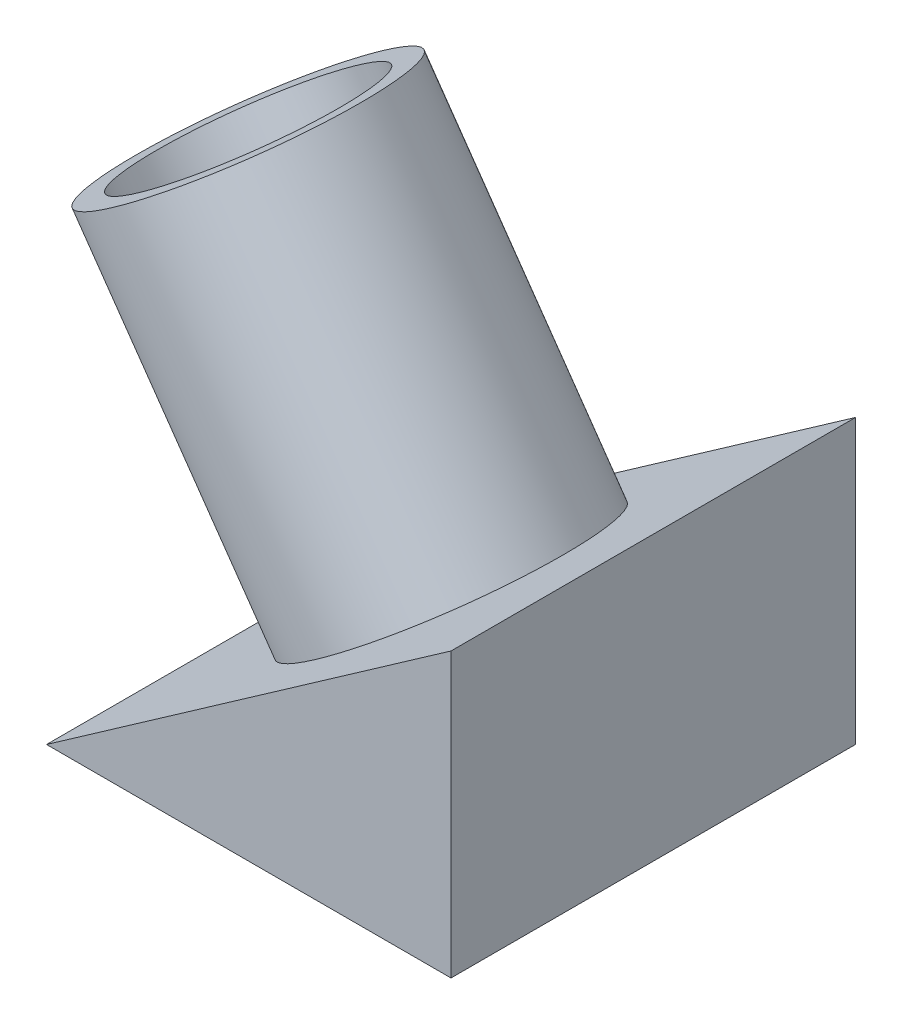
ISO-10303-21;
HEADER;
FILE_DESCRIPTION(('STEP AP214'),'2;1');
FILE_NAME('part.step','',(''),(''),'','','');
FILE_SCHEMA(('AUTOMOTIVE_DESIGN { 1 0 10303 214 1 1 1 1 }'));
ENDSEC;
DATA;
#1=APPLICATION_CONTEXT('core data for automotive mechanical design processes');
#2=APPLICATION_PROTOCOL_DEFINITION('international standard','automotive_design',2000,#1);
#3=PRODUCT_CONTEXT('',#1,'mechanical');
#4=PRODUCT('Part','Part','',(#3));
#5=PRODUCT_RELATED_PRODUCT_CATEGORY('part','',(#4));
#6=PRODUCT_DEFINITION_FORMATION('','',#4);
#7=PRODUCT_DEFINITION_CONTEXT('part definition',#1,'design');
#8=PRODUCT_DEFINITION('design','',#6,#7);
#9=PRODUCT_DEFINITION_SHAPE('','',#8);
#10=(LENGTH_UNIT() NAMED_UNIT(*) SI_UNIT(.MILLI.,.METRE.));
#11=(NAMED_UNIT(*) PLANE_ANGLE_UNIT() SI_UNIT($,.RADIAN.));
#12=(NAMED_UNIT(*) SI_UNIT($,.STERADIAN.) SOLID_ANGLE_UNIT());
#13=UNCERTAINTY_MEASURE_WITH_UNIT(LENGTH_MEASURE(1.E-05),#10,'distance_accuracy_value','');
#14=(GEOMETRIC_REPRESENTATION_CONTEXT(3) GLOBAL_UNCERTAINTY_ASSIGNED_CONTEXT((#13)) GLOBAL_UNIT_ASSIGNED_CONTEXT((#10,
#11,#12)) REPRESENTATION_CONTEXT('',''));
#15=CARTESIAN_POINT('',(0.,0.,0.));
#16=DIRECTION('',(0.,0.,1.));
#17=DIRECTION('',(1.,0.,0.));
#18=AXIS2_PLACEMENT_3D('',#15,#16,#17);
#19=CARTESIAN_POINT('',(40.,0.,40.));
#20=DIRECTION('',(0.,1.,0.));
#21=DIRECTION('',(-1.,0.,0.));
#22=AXIS2_PLACEMENT_3D('',#19,#20,#21);
#23=PLANE('',#22);
#24=DIRECTION('',(1.,0.,0.));
#25=VECTOR('',#24,1.);
#26=CARTESIAN_POINT('',(40.,0.,0.));
#27=LINE('',#26,#25);
#28=CARTESIAN_POINT('',(0.,0.,0.));
#29=VERTEX_POINT('',#28);
#30=CARTESIAN_POINT('',(40.,0.,0.));
#31=VERTEX_POINT('',#30);
#32=EDGE_CURVE('E92',#29,#31,#27,.T.);
#33=ORIENTED_EDGE('',*,*,#32,.T.);
#34=DIRECTION('',(0.,0.,-1.));
#35=VECTOR('',#34,1.);
#36=CARTESIAN_POINT('',(40.,0.,40.));
#37=LINE('',#36,#35);
#38=CARTESIAN_POINT('',(40.,0.,40.));
#39=VERTEX_POINT('',#38);
#40=EDGE_CURVE('E42',#39,#31,#37,.T.);
#41=ORIENTED_EDGE('',*,*,#40,.F.);
#42=DIRECTION('',(1.,0.,0.));
#43=VECTOR('',#42,1.);
#44=CARTESIAN_POINT('',(40.,0.,40.));
#45=LINE('',#44,#43);
#46=CARTESIAN_POINT('',(0.,0.,40.));
#47=VERTEX_POINT('',#46);
#48=EDGE_CURVE('E84',#47,#39,#45,.T.);
#49=ORIENTED_EDGE('',*,*,#48,.F.);
#50=DIRECTION('',(0.,0.,-1.));
#51=VECTOR('',#50,1.);
#52=CARTESIAN_POINT('',(0.,0.,40.));
#53=LINE('',#52,#51);
#54=EDGE_CURVE('E95',#47,#29,#53,.T.);
#55=ORIENTED_EDGE('',*,*,#54,.T.);
#56=EDGE_LOOP('',(#33,#41,#49,#55));
#57=FACE_BOUND('',#56,.T.);
#58=ADVANCED_FACE('F39',(#57),#23,.F.);
#59=CARTESIAN_POINT('',(40.,28.0083015283881,40.));
#60=DIRECTION('',(-1.,0.,0.));
#61=DIRECTION('',(0.,-1.,0.));
#62=AXIS2_PLACEMENT_3D('',#59,#60,#61);
#63=PLANE('',#62);
#64=DIRECTION('',(0.,1.,0.));
#65=VECTOR('',#64,1.);
#66=CARTESIAN_POINT('',(40.,28.0083015283881,0.));
#67=LINE('',#66,#65);
#68=CARTESIAN_POINT('',(40.,28.0083015283881,0.));
#69=VERTEX_POINT('',#68);
#70=EDGE_CURVE('E70',#31,#69,#67,.T.);
#71=ORIENTED_EDGE('',*,*,#70,.T.);
#72=DIRECTION('',(0.,0.,-1.));
#73=VECTOR('',#72,1.);
#74=CARTESIAN_POINT('',(40.,28.0083015283881,40.));
#75=LINE('',#74,#73);
#76=CARTESIAN_POINT('',(40.,28.0083015283881,40.));
#77=VERTEX_POINT('',#76);
#78=EDGE_CURVE('E82',#77,#69,#75,.T.);
#79=ORIENTED_EDGE('',*,*,#78,.F.);
#80=DIRECTION('',(0.,1.,0.));
#81=VECTOR('',#80,1.);
#82=CARTESIAN_POINT('',(40.,28.0083015283881,40.));
#83=LINE('',#82,#81);
#84=EDGE_CURVE('E78',#39,#77,#83,.T.);
#85=ORIENTED_EDGE('',*,*,#84,.F.);
#86=ORIENTED_EDGE('',*,*,#40,.T.);
#87=EDGE_LOOP('',(#71,#79,#85,#86));
#88=FACE_BOUND('',#87,.T.);
#89=ADVANCED_FACE('F79',(#88),#63,.F.);
#90=CARTESIAN_POINT('',(0.,0.,40.));
#91=DIRECTION('',(0.573576436351042,-0.819152044288995,0.));
#92=DIRECTION('',(0.819152044288995,0.573576436351042,0.));
#93=AXIS2_PLACEMENT_3D('',#90,#91,#92);
#94=PLANE('',#93);
#95=CARTESIAN_POINT('',(19.9995971613158,14.0038686935107,19.9836813982957));
#96=DIRECTION('',(-0.573576436351042,0.819152044288995,0.));
#97=DIRECTION('',(-0.819152044288995,-0.573576436351042,0.));
#98=AXIS2_PLACEMENT_3D('',#95,#96,#97);
#99=CIRCLE('',#98,13.5);
#100=CARTESIAN_POINT('',(8.94104456341438,6.26058680277162,19.9836813982957));
#101=VERTEX_POINT('',#100);
#102=EDGE_CURVE('E11',#101,#101,#99,.T.);
#103=ORIENTED_EDGE('',*,*,#102,.F.);
#104=EDGE_LOOP('',(#103));
#105=FACE_BOUND('',#104,.T.);
#106=DIRECTION('',(-0.819152044288995,-0.573576436351042,0.));
#107=VECTOR('',#106,1.);
#108=CARTESIAN_POINT('',(0.,0.,0.));
#109=LINE('',#108,#107);
#110=EDGE_CURVE('E75',#69,#29,#109,.T.);
#111=ORIENTED_EDGE('',*,*,#110,.T.);
#112=ORIENTED_EDGE('',*,*,#54,.F.);
#113=DIRECTION('',(-0.819152044288995,-0.573576436351042,0.));
#114=VECTOR('',#113,1.);
#115=CARTESIAN_POINT('',(0.,0.,40.));
#116=LINE('',#115,#114);
#117=EDGE_CURVE('E57',#77,#47,#116,.T.);
#118=ORIENTED_EDGE('',*,*,#117,.F.);
#119=ORIENTED_EDGE('',*,*,#78,.T.);
#120=EDGE_LOOP('',(#111,#112,#118,#119));
#121=FACE_BOUND('',#120,.T.);
#122=ADVANCED_FACE('F141',(#105,#121),#94,.F.);
#123=CARTESIAN_POINT('',(0.,0.,40.));
#124=DIRECTION('',(0.,0.,1.));
#125=DIRECTION('',(1.,0.,0.));
#126=AXIS2_PLACEMENT_3D('',#123,#124,#125);
#127=PLANE('',#126);
#128=ORIENTED_EDGE('',*,*,#48,.T.);
#129=ORIENTED_EDGE('',*,*,#84,.T.);
#130=ORIENTED_EDGE('',*,*,#117,.T.);
#131=EDGE_LOOP('',(#128,#129,#130));
#132=FACE_BOUND('',#131,.T.);
#133=ADVANCED_FACE('F87',(#132),#127,.T.);
#134=CARTESIAN_POINT('',(0.,0.,0.));
#135=DIRECTION('',(0.,0.,1.));
#136=DIRECTION('',(1.,0.,0.));
#137=AXIS2_PLACEMENT_3D('',#134,#135,#136);
#138=PLANE('',#137);
#139=ORIENTED_EDGE('',*,*,#32,.F.);
#140=ORIENTED_EDGE('',*,*,#110,.F.);
#141=ORIENTED_EDGE('',*,*,#70,.F.);
#142=EDGE_LOOP('',(#139,#140,#141));
#143=FACE_BOUND('',#142,.T.);
#144=ADVANCED_FACE('F137',(#143),#138,.F.);
#145=CARTESIAN_POINT('',(-0.0755781109706526,42.6741902436255,19.9836813982957));
#146=DIRECTION('',(0.573576436351042,-0.819152044288995,0.));
#147=DIRECTION('',(0.819152044288995,0.573576436351042,0.));
#148=AXIS2_PLACEMENT_3D('',#145,#146,#147);
#149=CYLINDRICAL_SURFACE('',#148,13.5);
#150=CARTESIAN_POINT('',(-0.0755781109706526,42.6741902436255,19.9836813982957));
#151=DIRECTION('',(-0.573576436351042,0.819152044288995,0.));
#152=DIRECTION('',(-0.819152044288995,-0.573576436351042,0.));
#153=AXIS2_PLACEMENT_3D('',#150,#151,#152);
#154=CIRCLE('',#153,13.5);
#155=CARTESIAN_POINT('',(-11.1341307088721,34.9309083528864,19.9836813982957));
#156=VERTEX_POINT('',#155);
#157=EDGE_CURVE('E105',#156,#156,#154,.T.);
#158=ORIENTED_EDGE('',*,*,#157,.F.);
#159=EDGE_LOOP('',(#158));
#160=FACE_BOUND('',#159,.T.);
#161=ORIENTED_EDGE('',*,*,#102,.T.);
#162=EDGE_LOOP('',(#161));
#163=FACE_BOUND('',#162,.T.);
#164=ADVANCED_FACE('F131',(#160,#163),#149,.T.);
#165=CARTESIAN_POINT('',(-0.0755781109706526,42.6741902436255,19.9836813982957));
#166=DIRECTION('',(-0.573576436351042,0.819152044288995,0.));
#167=DIRECTION('',(-0.819152044288995,-0.573576436351042,0.));
#168=AXIS2_PLACEMENT_3D('',#165,#166,#167);
#169=PLANE('',#168);
#170=CARTESIAN_POINT('',(-0.0755781109706595,42.6741902436255,19.9836813982957));
#171=DIRECTION('',(-0.573576436351042,0.819152044288995,0.));
#172=DIRECTION('',(-0.819152044288995,-0.573576436351042,0.));
#173=AXIS2_PLACEMENT_3D('',#170,#171,#172);
#174=CIRCLE('',#173,11.);
#175=CARTESIAN_POINT('',(-9.08625059814961,36.3648494437641,19.9836813982957));
#176=VERTEX_POINT('',#175);
#177=EDGE_CURVE('E112',#176,#176,#174,.T.);
#178=ORIENTED_EDGE('',*,*,#177,.F.);
#179=EDGE_LOOP('',(#178));
#180=FACE_BOUND('',#179,.T.);
#181=ORIENTED_EDGE('',*,*,#157,.T.);
#182=EDGE_LOOP('',(#181));
#183=FACE_BOUND('',#182,.T.);
#184=ADVANCED_FACE('F125',(#180,#183),#169,.T.);
#185=CARTESIAN_POINT('',(19.9995971613158,14.0038686935107,19.9836813982957));
#186=DIRECTION('',(-0.573576436351042,0.819152044288995,0.));
#187=DIRECTION('',(-0.819152044288995,-0.573576436351042,0.));
#188=AXIS2_PLACEMENT_3D('',#185,#186,#187);
#189=CYLINDRICAL_SURFACE('',#188,11.);
#190=CARTESIAN_POINT('',(19.9995971613158,14.0038686935107,19.9836813982957));
#191=DIRECTION('',(-0.573576436351042,0.819152044288995,0.));
#192=DIRECTION('',(-0.819152044288995,-0.573576436351042,0.));
#193=AXIS2_PLACEMENT_3D('',#190,#191,#192);
#194=CIRCLE('',#193,11.);
#195=CARTESIAN_POINT('',(10.9889246741369,7.69452789364924,19.9836813982957));
#196=VERTEX_POINT('',#195);
#197=EDGE_CURVE('E111',#196,#196,#194,.T.);
#198=ORIENTED_EDGE('',*,*,#197,.F.);
#199=EDGE_LOOP('',(#198));
#200=FACE_BOUND('',#199,.T.);
#201=ORIENTED_EDGE('',*,*,#177,.T.);
#202=EDGE_LOOP('',(#201));
#203=FACE_BOUND('',#202,.T.);
#204=ADVANCED_FACE('F122',(#200,#203),#189,.F.);
#205=CARTESIAN_POINT('',(19.9995971613158,14.0038686935107,19.9836813982957));
#206=DIRECTION('',(-0.573576436351042,0.819152044288995,0.));
#207=DIRECTION('',(-0.819152044288995,-0.573576436351042,0.));
#208=AXIS2_PLACEMENT_3D('',#205,#206,#207);
#209=PLANE('',#208);
#210=ORIENTED_EDGE('',*,*,#197,.T.);
#211=EDGE_LOOP('',(#210));
#212=FACE_BOUND('',#211,.T.);
#213=ADVANCED_FACE('F120',(#212),#209,.T.);
#214=CLOSED_SHELL('',(#58,#89,#122,#133,#144,#164,#184,#204,#213));
#215=MANIFOLD_SOLID_BREP('B2',#214);
#216=ADVANCED_BREP_SHAPE_REPRESENTATION('',(#18,#215),#14);
#217=SHAPE_DEFINITION_REPRESENTATION(#9,#216);
ENDSEC;
END-ISO-10303-21;
